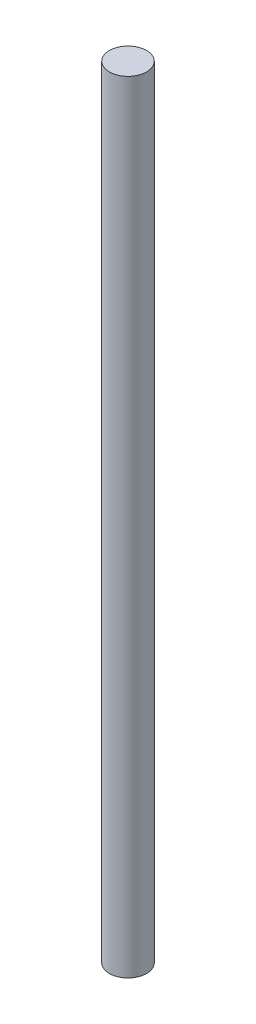
ISO-10303-21;
HEADER;
FILE_DESCRIPTION(('STEP AP214'),'2;1');
FILE_NAME('part.step','',(''),(''),'','','');
FILE_SCHEMA(('AUTOMOTIVE_DESIGN { 1 0 10303 214 1 1 1 1 }'));
ENDSEC;
DATA;
#1=APPLICATION_CONTEXT('core data for automotive mechanical design processes');
#2=APPLICATION_PROTOCOL_DEFINITION('international standard','automotive_design',2000,#1);
#3=PRODUCT_CONTEXT('',#1,'mechanical');
#4=PRODUCT('Part','Part','',(#3));
#5=PRODUCT_RELATED_PRODUCT_CATEGORY('part','',(#4));
#6=PRODUCT_DEFINITION_FORMATION('','',#4);
#7=PRODUCT_DEFINITION_CONTEXT('part definition',#1,'design');
#8=PRODUCT_DEFINITION('design','',#6,#7);
#9=PRODUCT_DEFINITION_SHAPE('','',#8);
#10=(LENGTH_UNIT() NAMED_UNIT(*) SI_UNIT(.MILLI.,.METRE.));
#11=(NAMED_UNIT(*) PLANE_ANGLE_UNIT() SI_UNIT($,.RADIAN.));
#12=(NAMED_UNIT(*) SI_UNIT($,.STERADIAN.) SOLID_ANGLE_UNIT());
#13=UNCERTAINTY_MEASURE_WITH_UNIT(LENGTH_MEASURE(1.E-05),#10,'distance_accuracy_value','');
#14=(GEOMETRIC_REPRESENTATION_CONTEXT(3) GLOBAL_UNCERTAINTY_ASSIGNED_CONTEXT((#13)) GLOBAL_UNIT_ASSIGNED_CONTEXT((#10,
#11,#12)) REPRESENTATION_CONTEXT('',''));
#15=CARTESIAN_POINT('',(0.,0.,0.));
#16=DIRECTION('',(0.,0.,1.));
#17=DIRECTION('',(1.,0.,0.));
#18=AXIS2_PLACEMENT_3D('',#15,#16,#17);
#19=CARTESIAN_POINT('',(0.,63.,0.));
#20=DIRECTION('',(0.,-1.,0.));
#21=DIRECTION('',(0.,0.,-1.));
#22=AXIS2_PLACEMENT_3D('',#19,#20,#21);
#23=CYLINDRICAL_SURFACE('',#22,1.5);
#24=CARTESIAN_POINT('',(0.,63.,0.));
#25=DIRECTION('',(0.,1.,0.));
#26=DIRECTION('',(0.,0.,1.));
#27=AXIS2_PLACEMENT_3D('',#24,#25,#26);
#28=CIRCLE('',#27,1.5);
#29=CARTESIAN_POINT('',(0.,63.,1.5));
#30=VERTEX_POINT('',#29);
#31=EDGE_CURVE('E10',#30,#30,#28,.T.);
#32=ORIENTED_EDGE('',*,*,#31,.F.);
#33=EDGE_LOOP('',(#32));
#34=FACE_BOUND('',#33,.T.);
#35=CARTESIAN_POINT('',(0.,0.,0.));
#36=DIRECTION('',(0.,1.,0.));
#37=DIRECTION('',(0.,0.,1.));
#38=AXIS2_PLACEMENT_3D('',#35,#36,#37);
#39=CIRCLE('',#38,1.5);
#40=CARTESIAN_POINT('',(0.,0.,1.5));
#41=VERTEX_POINT('',#40);
#42=EDGE_CURVE('E34',#41,#41,#39,.T.);
#43=ORIENTED_EDGE('',*,*,#42,.T.);
#44=EDGE_LOOP('',(#43));
#45=FACE_BOUND('',#44,.T.);
#46=ADVANCED_FACE('F31',(#34,#45),#23,.T.);
#47=CARTESIAN_POINT('',(0.,63.,0.));
#48=DIRECTION('',(0.,1.,0.));
#49=DIRECTION('',(0.,0.,1.));
#50=AXIS2_PLACEMENT_3D('',#47,#48,#49);
#51=PLANE('',#50);
#52=ORIENTED_EDGE('',*,*,#31,.T.);
#53=EDGE_LOOP('',(#52));
#54=FACE_BOUND('',#53,.T.);
#55=ADVANCED_FACE('F46',(#54),#51,.T.);
#56=CARTESIAN_POINT('',(0.,0.,0.));
#57=DIRECTION('',(0.,1.,0.));
#58=DIRECTION('',(0.,0.,1.));
#59=AXIS2_PLACEMENT_3D('',#56,#57,#58);
#60=PLANE('',#59);
#61=ORIENTED_EDGE('',*,*,#42,.F.);
#62=EDGE_LOOP('',(#61));
#63=FACE_BOUND('',#62,.T.);
#64=ADVANCED_FACE('F44',(#63),#60,.F.);
#65=CLOSED_SHELL('',(#46,#55,#64));
#66=MANIFOLD_SOLID_BREP('B2',#65);
#67=ADVANCED_BREP_SHAPE_REPRESENTATION('',(#18,#66),#14);
#68=SHAPE_DEFINITION_REPRESENTATION(#9,#67);
ENDSEC;
END-ISO-10303-21;
